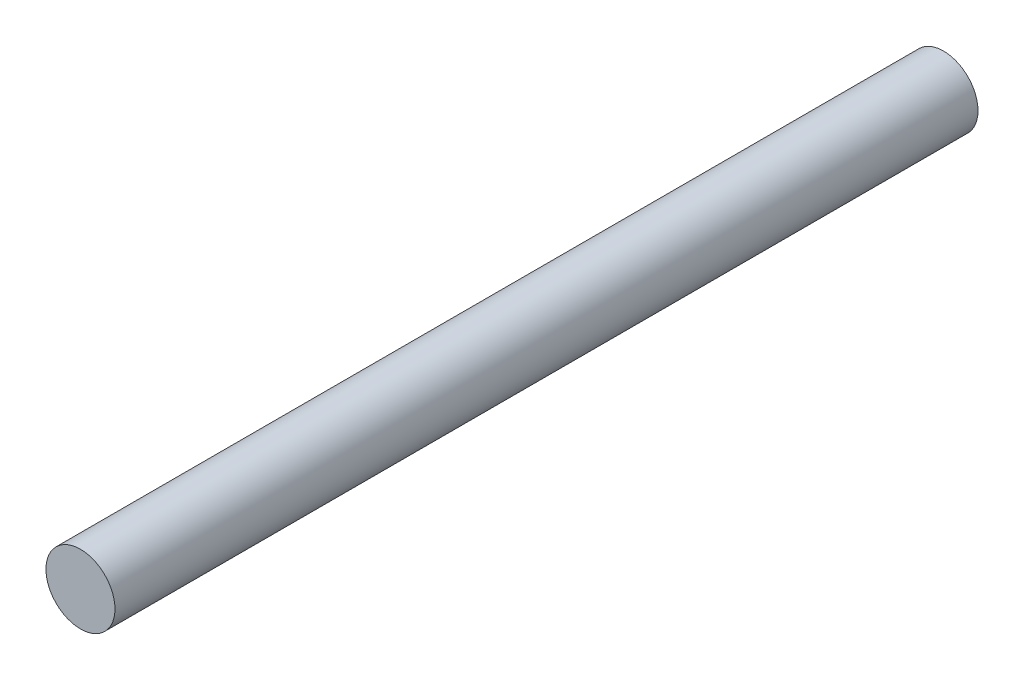
ISO-10303-21;
HEADER;
FILE_DESCRIPTION(('STEP AP214'),'2;1');
FILE_NAME('part.step','',(''),(''),'','','');
FILE_SCHEMA(('AUTOMOTIVE_DESIGN { 1 0 10303 214 1 1 1 1 }'));
ENDSEC;
DATA;
#1=APPLICATION_CONTEXT('core data for automotive mechanical design processes');
#2=APPLICATION_PROTOCOL_DEFINITION('international standard','automotive_design',2000,#1);
#3=PRODUCT_CONTEXT('',#1,'mechanical');
#4=PRODUCT('Part','Part','',(#3));
#5=PRODUCT_RELATED_PRODUCT_CATEGORY('part','',(#4));
#6=PRODUCT_DEFINITION_FORMATION('','',#4);
#7=PRODUCT_DEFINITION_CONTEXT('part definition',#1,'design');
#8=PRODUCT_DEFINITION('design','',#6,#7);
#9=PRODUCT_DEFINITION_SHAPE('','',#8);
#10=(LENGTH_UNIT() NAMED_UNIT(*) SI_UNIT(.MILLI.,.METRE.));
#11=(NAMED_UNIT(*) PLANE_ANGLE_UNIT() SI_UNIT($,.RADIAN.));
#12=(NAMED_UNIT(*) SI_UNIT($,.STERADIAN.) SOLID_ANGLE_UNIT());
#13=UNCERTAINTY_MEASURE_WITH_UNIT(LENGTH_MEASURE(1.E-05),#10,'distance_accuracy_value','');
#14=(GEOMETRIC_REPRESENTATION_CONTEXT(3) GLOBAL_UNCERTAINTY_ASSIGNED_CONTEXT((#13)) GLOBAL_UNIT_ASSIGNED_CONTEXT((#10,
#11,#12)) REPRESENTATION_CONTEXT('',''));
#15=CARTESIAN_POINT('',(0.,0.,0.));
#16=DIRECTION('',(0.,0.,1.));
#17=DIRECTION('',(1.,0.,0.));
#18=AXIS2_PLACEMENT_3D('',#15,#16,#17);
#19=CARTESIAN_POINT('',(0.,0.,63.5));
#20=DIRECTION('',(0.,0.,-1.));
#21=DIRECTION('',(-1.,0.,0.));
#22=AXIS2_PLACEMENT_3D('',#19,#20,#21);
#23=CYLINDRICAL_SURFACE('',#22,2.54);
#24=CARTESIAN_POINT('',(0.,0.,63.5));
#25=DIRECTION('',(0.,0.,1.));
#26=DIRECTION('',(1.,0.,0.));
#27=AXIS2_PLACEMENT_3D('',#24,#25,#26);
#28=CIRCLE('',#27,2.54);
#29=CARTESIAN_POINT('',(2.54,0.,63.5));
#30=VERTEX_POINT('',#29);
#31=EDGE_CURVE('E10',#30,#30,#28,.T.);
#32=ORIENTED_EDGE('',*,*,#31,.F.);
#33=EDGE_LOOP('',(#32));
#34=FACE_BOUND('',#33,.T.);
#35=CARTESIAN_POINT('',(0.,0.,0.));
#36=DIRECTION('',(0.,0.,1.));
#37=DIRECTION('',(1.,0.,0.));
#38=AXIS2_PLACEMENT_3D('',#35,#36,#37);
#39=CIRCLE('',#38,2.54);
#40=CARTESIAN_POINT('',(2.54,0.,0.));
#41=VERTEX_POINT('',#40);
#42=EDGE_CURVE('E38',#41,#41,#39,.T.);
#43=ORIENTED_EDGE('',*,*,#42,.T.);
#44=EDGE_LOOP('',(#43));
#45=FACE_BOUND('',#44,.T.);
#46=ADVANCED_FACE('F35',(#34,#45),#23,.T.);
#47=CARTESIAN_POINT('',(0.,0.,63.5));
#48=DIRECTION('',(0.,0.,1.));
#49=DIRECTION('',(1.,0.,0.));
#50=AXIS2_PLACEMENT_3D('',#47,#48,#49);
#51=PLANE('',#50);
#52=ORIENTED_EDGE('',*,*,#31,.T.);
#53=EDGE_LOOP('',(#52));
#54=FACE_BOUND('',#53,.T.);
#55=ADVANCED_FACE('F50',(#54),#51,.T.);
#56=CARTESIAN_POINT('',(0.,0.,0.));
#57=DIRECTION('',(0.,0.,1.));
#58=DIRECTION('',(1.,0.,0.));
#59=AXIS2_PLACEMENT_3D('',#56,#57,#58);
#60=PLANE('',#59);
#61=ORIENTED_EDGE('',*,*,#42,.F.);
#62=EDGE_LOOP('',(#61));
#63=FACE_BOUND('',#62,.T.);
#64=ADVANCED_FACE('F48',(#63),#60,.F.);
#65=CLOSED_SHELL('',(#46,#55,#64));
#66=MANIFOLD_SOLID_BREP('B2',#65);
#67=ADVANCED_BREP_SHAPE_REPRESENTATION('',(#18,#66),#14);
#68=SHAPE_DEFINITION_REPRESENTATION(#9,#67);
ENDSEC;
END-ISO-10303-21;
